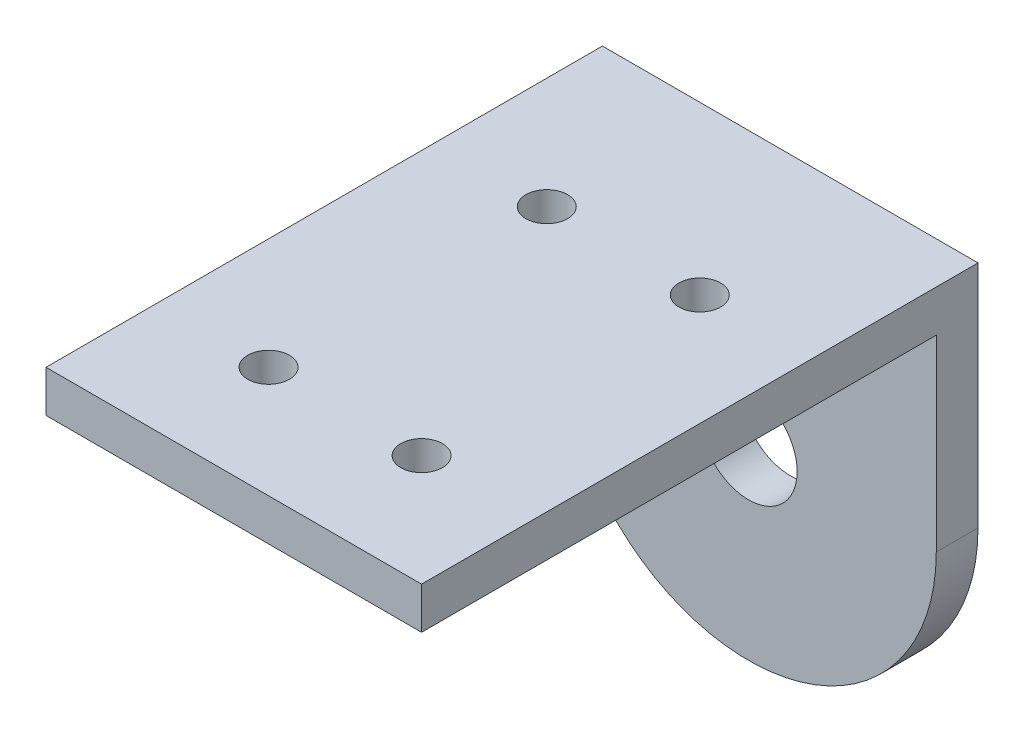
ISO-10303-21;
HEADER;
FILE_DESCRIPTION(('STEP AP214'),'2;1');
FILE_NAME('part.step','',(''),(''),'','','');
FILE_SCHEMA(('AUTOMOTIVE_DESIGN { 1 0 10303 214 1 1 1 1 }'));
ENDSEC;
DATA;
#1=APPLICATION_CONTEXT('core data for automotive mechanical design processes');
#2=APPLICATION_PROTOCOL_DEFINITION('international standard','automotive_design',2000,#1);
#3=PRODUCT_CONTEXT('',#1,'mechanical');
#4=PRODUCT('Part','Part','',(#3));
#5=PRODUCT_RELATED_PRODUCT_CATEGORY('part','',(#4));
#6=PRODUCT_DEFINITION_FORMATION('','',#4);
#7=PRODUCT_DEFINITION_CONTEXT('part definition',#1,'design');
#8=PRODUCT_DEFINITION('design','',#6,#7);
#9=PRODUCT_DEFINITION_SHAPE('','',#8);
#10=(LENGTH_UNIT() NAMED_UNIT(*) SI_UNIT(.MILLI.,.METRE.));
#11=(NAMED_UNIT(*) PLANE_ANGLE_UNIT() SI_UNIT($,.RADIAN.));
#12=(NAMED_UNIT(*) SI_UNIT($,.STERADIAN.) SOLID_ANGLE_UNIT());
#13=UNCERTAINTY_MEASURE_WITH_UNIT(LENGTH_MEASURE(1.E-05),#10,'distance_accuracy_value','');
#14=(GEOMETRIC_REPRESENTATION_CONTEXT(3) GLOBAL_UNCERTAINTY_ASSIGNED_CONTEXT((#13)) GLOBAL_UNIT_ASSIGNED_CONTEXT((#10,
#11,#12)) REPRESENTATION_CONTEXT('',''));
#15=CARTESIAN_POINT('',(0.,0.,0.));
#16=DIRECTION('',(0.,0.,1.));
#17=DIRECTION('',(1.,0.,0.));
#18=AXIS2_PLACEMENT_3D('',#15,#16,#17);
#19=CARTESIAN_POINT('',(2606.26671450499,1592.8264256332,40.));
#20=DIRECTION('',(0.,0.,1.));
#21=DIRECTION('',(1.,0.,0.));
#22=AXIS2_PLACEMENT_3D('',#19,#20,#21);
#23=PLANE('',#22);
#24=DIRECTION('',(1.,0.,0.));
#25=VECTOR('',#24,1.);
#26=CARTESIAN_POINT('',(2579.76671450502,1606.3264256332,40.));
#27=LINE('',#26,#25);
#28=CARTESIAN_POINT('',(2592.76671450499,1606.3264256332,40.));
#29=VERTEX_POINT('',#28);
#30=CARTESIAN_POINT('',(2619.76671450502,1606.3264256332,40.));
#31=VERTEX_POINT('',#30);
#32=EDGE_CURVE('E122',#29,#31,#27,.T.);
#33=ORIENTED_EDGE('',*,*,#32,.T.);
#34=DIRECTION('',(0.,1.,0.));
#35=VECTOR('',#34,1.);
#36=CARTESIAN_POINT('',(2619.76671450499,1592.8264256332,40.));
#37=LINE('',#36,#35);
#38=CARTESIAN_POINT('',(2619.76671450499,1609.3264256332,40.));
#39=VERTEX_POINT('',#38);
#40=EDGE_CURVE('E98',#31,#39,#37,.T.);
#41=ORIENTED_EDGE('',*,*,#40,.T.);
#42=DIRECTION('',(-1.,0.,0.));
#43=VECTOR('',#42,1.);
#44=CARTESIAN_POINT('',(2592.76671450499,1609.3264256332,40.));
#45=LINE('',#44,#43);
#46=CARTESIAN_POINT('',(2592.76671450499,1609.3264256332,40.));
#47=VERTEX_POINT('',#46);
#48=EDGE_CURVE('E58',#39,#47,#45,.T.);
#49=ORIENTED_EDGE('',*,*,#48,.T.);
#50=DIRECTION('',(0.,-1.,0.));
#51=VECTOR('',#50,1.);
#52=CARTESIAN_POINT('',(2592.76671450499,1592.8264256332,40.));
#53=LINE('',#52,#51);
#54=EDGE_CURVE('E89',#47,#29,#53,.T.);
#55=ORIENTED_EDGE('',*,*,#54,.T.);
#56=EDGE_LOOP('',(#33,#41,#49,#55));
#57=FACE_BOUND('',#56,.T.);
#58=ADVANCED_FACE('F32',(#57),#23,.T.);
#59=CARTESIAN_POINT('',(2606.26671450499,1592.8264256332,0.));
#60=DIRECTION('',(0.,0.,1.));
#61=DIRECTION('',(1.,0.,0.));
#62=AXIS2_PLACEMENT_3D('',#59,#60,#61);
#63=PLANE('',#62);
#64=CARTESIAN_POINT('',(2606.26671450499,1592.8264256332,0.));
#65=DIRECTION('',(0.,0.,1.));
#66=DIRECTION('',(1.,0.,0.));
#67=AXIS2_PLACEMENT_3D('',#64,#65,#66);
#68=CIRCLE('',#67,13.5000000000001);
#69=CARTESIAN_POINT('',(2592.76671450499,1592.8264256332,0.));
#70=VERTEX_POINT('',#69);
#71=CARTESIAN_POINT('',(2619.76671450499,1592.8264256332,0.));
#72=VERTEX_POINT('',#71);
#73=EDGE_CURVE('E82',#70,#72,#68,.T.);
#74=ORIENTED_EDGE('',*,*,#73,.F.);
#75=DIRECTION('',(0.,-1.,0.));
#76=VECTOR('',#75,1.);
#77=CARTESIAN_POINT('',(2592.76671450499,1592.8264256332,0.));
#78=LINE('',#77,#76);
#79=CARTESIAN_POINT('',(2592.76671450499,1609.3264256332,0.));
#80=VERTEX_POINT('',#79);
#81=EDGE_CURVE('E93',#80,#70,#78,.T.);
#82=ORIENTED_EDGE('',*,*,#81,.F.);
#83=DIRECTION('',(-1.,0.,0.));
#84=VECTOR('',#83,1.);
#85=CARTESIAN_POINT('',(2592.76671450499,1609.3264256332,0.));
#86=LINE('',#85,#84);
#87=CARTESIAN_POINT('',(2619.76671450499,1609.3264256332,0.));
#88=VERTEX_POINT('',#87);
#89=EDGE_CURVE('E99',#88,#80,#86,.T.);
#90=ORIENTED_EDGE('',*,*,#89,.F.);
#91=DIRECTION('',(0.,1.,0.));
#92=VECTOR('',#91,1.);
#93=CARTESIAN_POINT('',(2619.76671450499,1592.8264256332,0.));
#94=LINE('',#93,#92);
#95=EDGE_CURVE('E104',#72,#88,#94,.T.);
#96=ORIENTED_EDGE('',*,*,#95,.F.);
#97=EDGE_LOOP('',(#74,#82,#90,#96));
#98=FACE_BOUND('',#97,.T.);
#99=CARTESIAN_POINT('',(2606.26671450499,1592.8264256332,0.));
#100=DIRECTION('',(0.,0.,1.));
#101=DIRECTION('',(1.,0.,0.));
#102=AXIS2_PLACEMENT_3D('',#99,#100,#101);
#103=CIRCLE('',#102,3.49999999999984);
#104=CARTESIAN_POINT('',(2609.76671450499,1592.8264256332,0.));
#105=VERTEX_POINT('',#104);
#106=EDGE_CURVE('E105',#105,#105,#103,.T.);
#107=ORIENTED_EDGE('',*,*,#106,.T.);
#108=EDGE_LOOP('',(#107));
#109=FACE_BOUND('',#108,.T.);
#110=ADVANCED_FACE('F102',(#98,#109),#63,.F.);
#111=CARTESIAN_POINT('',(2606.26671450499,1592.8264256332,40.));
#112=DIRECTION('',(0.,0.,-1.));
#113=DIRECTION('',(-1.,0.,0.));
#114=AXIS2_PLACEMENT_3D('',#111,#112,#113);
#115=CYLINDRICAL_SURFACE('',#114,13.5000000000001);
#116=DIRECTION('',(0.,0.,-1.));
#117=VECTOR('',#116,1.);
#118=CARTESIAN_POINT('',(2619.76671450499,1592.8264256332,40.));
#119=LINE('',#118,#117);
#120=CARTESIAN_POINT('',(2619.76671450502,1592.8264256332,3.));
#121=VERTEX_POINT('',#120);
#122=EDGE_CURVE('E41',#121,#72,#119,.T.);
#123=ORIENTED_EDGE('',*,*,#122,.F.);
#124=CARTESIAN_POINT('',(2606.26671450499,1592.8264256332,3.));
#125=DIRECTION('',(0.,0.,-1.));
#126=DIRECTION('',(0.,1.,0.));
#127=AXIS2_PLACEMENT_3D('',#124,#125,#126);
#128=CIRCLE('',#127,13.5000000000001);
#129=CARTESIAN_POINT('',(2592.76671450499,1592.8264256332,3.));
#130=VERTEX_POINT('',#129);
#131=EDGE_CURVE('E85',#121,#130,#128,.T.);
#132=ORIENTED_EDGE('',*,*,#131,.T.);
#133=DIRECTION('',(0.,0.,-1.));
#134=VECTOR('',#133,1.);
#135=CARTESIAN_POINT('',(2592.76671450499,1592.8264256332,40.));
#136=LINE('',#135,#134);
#137=EDGE_CURVE('E78',#130,#70,#136,.T.);
#138=ORIENTED_EDGE('',*,*,#137,.T.);
#139=ORIENTED_EDGE('',*,*,#73,.T.);
#140=EDGE_LOOP('',(#123,#132,#138,#139));
#141=FACE_BOUND('',#140,.T.);
#142=ADVANCED_FACE('F34',(#141),#115,.T.);
#143=CARTESIAN_POINT('',(2619.76671450499,1592.8264256332,40.));
#144=DIRECTION('',(-1.,0.,0.));
#145=DIRECTION('',(0.,0.,1.));
#146=AXIS2_PLACEMENT_3D('',#143,#144,#145);
#147=PLANE('',#146);
#148=ORIENTED_EDGE('',*,*,#40,.F.);
#149=DIRECTION('',(0.,0.,1.));
#150=VECTOR('',#149,1.);
#151=CARTESIAN_POINT('',(2619.76671450502,1606.3264256332,40.));
#152=LINE('',#151,#150);
#153=CARTESIAN_POINT('',(2619.76671450502,1606.3264256332,3.));
#154=VERTEX_POINT('',#153);
#155=EDGE_CURVE('E150',#154,#31,#152,.T.);
#156=ORIENTED_EDGE('',*,*,#155,.F.);
#157=DIRECTION('',(0.,1.,0.));
#158=VECTOR('',#157,1.);
#159=CARTESIAN_POINT('',(2619.76671450502,1606.3264256332,3.));
#160=LINE('',#159,#158);
#161=EDGE_CURVE('E127',#121,#154,#160,.T.);
#162=ORIENTED_EDGE('',*,*,#161,.F.);
#163=ORIENTED_EDGE('',*,*,#122,.T.);
#164=ORIENTED_EDGE('',*,*,#95,.T.);
#165=DIRECTION('',(0.,0.,-1.));
#166=VECTOR('',#165,1.);
#167=CARTESIAN_POINT('',(2619.76671450499,1609.3264256332,40.));
#168=LINE('',#167,#166);
#169=EDGE_CURVE('E115',#39,#88,#168,.T.);
#170=ORIENTED_EDGE('',*,*,#169,.F.);
#171=EDGE_LOOP('',(#148,#156,#162,#163,#164,#170));
#172=FACE_BOUND('',#171,.T.);
#173=ADVANCED_FACE('F169',(#172),#147,.F.);
#174=CARTESIAN_POINT('',(2592.76671450499,1609.3264256332,40.));
#175=DIRECTION('',(0.,-1.,0.));
#176=DIRECTION('',(0.,0.,-1.));
#177=AXIS2_PLACEMENT_3D('',#174,#175,#176);
#178=PLANE('',#177);
#179=CARTESIAN_POINT('',(2600.76671450499,1609.3264256332,12.));
#180=DIRECTION('',(0.,1.,0.));
#181=DIRECTION('',(0.,0.,1.));
#182=AXIS2_PLACEMENT_3D('',#179,#180,#181);
#183=CIRCLE('',#182,1.50000000000008);
#184=CARTESIAN_POINT('',(2600.76671450499,1609.3264256332,13.5000000000001));
#185=VERTEX_POINT('',#184);
#186=EDGE_CURVE('E144',#185,#185,#183,.T.);
#187=ORIENTED_EDGE('',*,*,#186,.F.);
#188=EDGE_LOOP('',(#187));
#189=FACE_BOUND('',#188,.T.);
#190=CARTESIAN_POINT('',(2611.76671450499,1609.3264256332,12.));
#191=DIRECTION('',(0.,1.,0.));
#192=DIRECTION('',(0.,0.,1.));
#193=AXIS2_PLACEMENT_3D('',#190,#191,#192);
#194=CIRCLE('',#193,1.50000000000008);
#195=CARTESIAN_POINT('',(2611.76671450499,1609.3264256332,13.5000000000001));
#196=VERTEX_POINT('',#195);
#197=EDGE_CURVE('E134',#196,#196,#194,.T.);
#198=ORIENTED_EDGE('',*,*,#197,.F.);
#199=EDGE_LOOP('',(#198));
#200=FACE_BOUND('',#199,.T.);
#201=CARTESIAN_POINT('',(2611.76671450499,1609.3264256332,32.));
#202=DIRECTION('',(0.,1.,0.));
#203=DIRECTION('',(0.,0.,1.));
#204=AXIS2_PLACEMENT_3D('',#201,#202,#203);
#205=CIRCLE('',#204,1.50000000000008);
#206=CARTESIAN_POINT('',(2611.76671450499,1609.3264256332,33.5000000000001));
#207=VERTEX_POINT('',#206);
#208=EDGE_CURVE('E131',#207,#207,#205,.T.);
#209=ORIENTED_EDGE('',*,*,#208,.F.);
#210=EDGE_LOOP('',(#209));
#211=FACE_BOUND('',#210,.T.);
#212=CARTESIAN_POINT('',(2600.76671450499,1609.3264256332,32.));
#213=DIRECTION('',(0.,1.,0.));
#214=DIRECTION('',(0.,0.,1.));
#215=AXIS2_PLACEMENT_3D('',#212,#213,#214);
#216=CIRCLE('',#215,1.50000000000008);
#217=CARTESIAN_POINT('',(2600.76671450499,1609.3264256332,33.5000000000001));
#218=VERTEX_POINT('',#217);
#219=EDGE_CURVE('E128',#218,#218,#216,.T.);
#220=ORIENTED_EDGE('',*,*,#219,.F.);
#221=EDGE_LOOP('',(#220));
#222=FACE_BOUND('',#221,.T.);
#223=ORIENTED_EDGE('',*,*,#89,.T.);
#224=DIRECTION('',(0.,0.,-1.));
#225=VECTOR('',#224,1.);
#226=CARTESIAN_POINT('',(2592.76671450499,1609.3264256332,40.));
#227=LINE('',#226,#225);
#228=EDGE_CURVE('E88',#47,#80,#227,.T.);
#229=ORIENTED_EDGE('',*,*,#228,.F.);
#230=ORIENTED_EDGE('',*,*,#48,.F.);
#231=ORIENTED_EDGE('',*,*,#169,.T.);
#232=EDGE_LOOP('',(#223,#229,#230,#231));
#233=FACE_BOUND('',#232,.T.);
#234=ADVANCED_FACE('F199',(#189,#200,#211,#222,#233),#178,.F.);
#235=CARTESIAN_POINT('',(2592.76671450499,1592.8264256332,40.));
#236=DIRECTION('',(1.,0.,0.));
#237=DIRECTION('',(0.,0.,-1.));
#238=AXIS2_PLACEMENT_3D('',#235,#236,#237);
#239=PLANE('',#238);
#240=DIRECTION('',(0.,1.,0.));
#241=VECTOR('',#240,1.);
#242=CARTESIAN_POINT('',(2592.76671450499,1592.8264256332,3.));
#243=LINE('',#242,#241);
#244=CARTESIAN_POINT('',(2592.76671450499,1606.3264256332,3.));
#245=VERTEX_POINT('',#244);
#246=EDGE_CURVE('E121',#130,#245,#243,.T.);
#247=ORIENTED_EDGE('',*,*,#246,.T.);
#248=DIRECTION('',(0.,0.,1.));
#249=VECTOR('',#248,1.);
#250=CARTESIAN_POINT('',(2592.76671450499,1606.3264256332,40.));
#251=LINE('',#250,#249);
#252=EDGE_CURVE('E11',#245,#29,#251,.T.);
#253=ORIENTED_EDGE('',*,*,#252,.T.);
#254=ORIENTED_EDGE('',*,*,#54,.F.);
#255=ORIENTED_EDGE('',*,*,#228,.T.);
#256=ORIENTED_EDGE('',*,*,#81,.T.);
#257=ORIENTED_EDGE('',*,*,#137,.F.);
#258=EDGE_LOOP('',(#247,#253,#254,#255,#256,#257));
#259=FACE_BOUND('',#258,.T.);
#260=ADVANCED_FACE('F94',(#259),#239,.F.);
#261=CARTESIAN_POINT('',(2606.26671450499,1592.8264256332,40.));
#262=DIRECTION('',(0.,0.,-1.));
#263=DIRECTION('',(-1.,0.,0.));
#264=AXIS2_PLACEMENT_3D('',#261,#262,#263);
#265=CYLINDRICAL_SURFACE('',#264,3.49999999999984);
#266=CARTESIAN_POINT('',(2606.26671450499,1592.8264256332,3.));
#267=DIRECTION('',(0.,0.,-1.));
#268=DIRECTION('',(0.,1.,0.));
#269=AXIS2_PLACEMENT_3D('',#266,#267,#268);
#270=CIRCLE('',#269,3.49999999999984);
#271=CARTESIAN_POINT('',(2606.26671450499,1596.3264256332,3.));
#272=VERTEX_POINT('',#271);
#273=EDGE_CURVE('E119',#272,#272,#270,.T.);
#274=ORIENTED_EDGE('',*,*,#273,.F.);
#275=EDGE_LOOP('',(#274));
#276=FACE_BOUND('',#275,.T.);
#277=ORIENTED_EDGE('',*,*,#106,.F.);
#278=EDGE_LOOP('',(#277));
#279=FACE_BOUND('',#278,.T.);
#280=ADVANCED_FACE('F186',(#276,#279),#265,.F.);
#281=CARTESIAN_POINT('',(2579.76671450502,1606.3264256332,40.));
#282=DIRECTION('',(0.,1.,0.));
#283=DIRECTION('',(-1.,0.,0.));
#284=AXIS2_PLACEMENT_3D('',#281,#282,#283);
#285=PLANE('',#284);
#286=CARTESIAN_POINT('',(2600.76671450499,1606.3264256332,12.));
#287=DIRECTION('',(0.,1.,0.));
#288=DIRECTION('',(-1.,0.,0.));
#289=AXIS2_PLACEMENT_3D('',#286,#287,#288);
#290=CIRCLE('',#289,1.50000000000008);
#291=CARTESIAN_POINT('',(2599.26671450499,1606.3264256332,12.));
#292=VERTEX_POINT('',#291);
#293=EDGE_CURVE('E36',#292,#292,#290,.T.);
#294=ORIENTED_EDGE('',*,*,#293,.T.);
#295=EDGE_LOOP('',(#294));
#296=FACE_BOUND('',#295,.T.);
#297=CARTESIAN_POINT('',(2611.76671450499,1606.3264256332,12.));
#298=DIRECTION('',(0.,1.,0.));
#299=DIRECTION('',(-1.,0.,0.));
#300=AXIS2_PLACEMENT_3D('',#297,#298,#299);
#301=CIRCLE('',#300,1.50000000000008);
#302=CARTESIAN_POINT('',(2610.26671450499,1606.3264256332,12.));
#303=VERTEX_POINT('',#302);
#304=EDGE_CURVE('E132',#303,#303,#301,.T.);
#305=ORIENTED_EDGE('',*,*,#304,.T.);
#306=EDGE_LOOP('',(#305));
#307=FACE_BOUND('',#306,.T.);
#308=CARTESIAN_POINT('',(2611.76671450499,1606.3264256332,32.));
#309=DIRECTION('',(0.,1.,0.));
#310=DIRECTION('',(-1.,0.,0.));
#311=AXIS2_PLACEMENT_3D('',#308,#309,#310);
#312=CIRCLE('',#311,1.50000000000008);
#313=CARTESIAN_POINT('',(2610.26671450499,1606.3264256332,32.));
#314=VERTEX_POINT('',#313);
#315=EDGE_CURVE('E129',#314,#314,#312,.T.);
#316=ORIENTED_EDGE('',*,*,#315,.T.);
#317=EDGE_LOOP('',(#316));
#318=FACE_BOUND('',#317,.T.);
#319=CARTESIAN_POINT('',(2600.76671450499,1606.3264256332,32.));
#320=DIRECTION('',(0.,1.,0.));
#321=DIRECTION('',(-1.,0.,0.));
#322=AXIS2_PLACEMENT_3D('',#319,#320,#321);
#323=CIRCLE('',#322,1.50000000000008);
#324=CARTESIAN_POINT('',(2599.26671450499,1606.3264256332,32.));
#325=VERTEX_POINT('',#324);
#326=EDGE_CURVE('E124',#325,#325,#323,.T.);
#327=ORIENTED_EDGE('',*,*,#326,.T.);
#328=EDGE_LOOP('',(#327));
#329=FACE_BOUND('',#328,.T.);
#330=DIRECTION('',(1.,0.,0.));
#331=VECTOR('',#330,1.);
#332=CARTESIAN_POINT('',(2579.76671450502,1606.3264256332,3.));
#333=LINE('',#332,#331);
#334=EDGE_CURVE('E49',#245,#154,#333,.T.);
#335=ORIENTED_EDGE('',*,*,#334,.T.);
#336=ORIENTED_EDGE('',*,*,#155,.T.);
#337=ORIENTED_EDGE('',*,*,#32,.F.);
#338=ORIENTED_EDGE('',*,*,#252,.F.);
#339=EDGE_LOOP('',(#335,#336,#337,#338));
#340=FACE_BOUND('',#339,.T.);
#341=ADVANCED_FACE('F162',(#296,#307,#318,#329,#340),#285,.F.);
#342=CARTESIAN_POINT('',(2579.76671450502,1606.3264256332,3.));
#343=DIRECTION('',(0.,0.,-1.));
#344=DIRECTION('',(0.,1.,0.));
#345=AXIS2_PLACEMENT_3D('',#342,#343,#344);
#346=PLANE('',#345);
#347=ORIENTED_EDGE('',*,*,#273,.T.);
#348=EDGE_LOOP('',(#347));
#349=FACE_BOUND('',#348,.T.);
#350=ORIENTED_EDGE('',*,*,#161,.T.);
#351=ORIENTED_EDGE('',*,*,#334,.F.);
#352=ORIENTED_EDGE('',*,*,#246,.F.);
#353=ORIENTED_EDGE('',*,*,#131,.F.);
#354=EDGE_LOOP('',(#350,#351,#352,#353));
#355=FACE_BOUND('',#354,.T.);
#356=ADVANCED_FACE('F174',(#349,#355),#346,.F.);
#357=CARTESIAN_POINT('',(2600.76671450499,1569.3264256332,32.));
#358=DIRECTION('',(0.,1.,0.));
#359=DIRECTION('',(0.,0.,1.));
#360=AXIS2_PLACEMENT_3D('',#357,#358,#359);
#361=CYLINDRICAL_SURFACE('',#360,1.50000000000008);
#362=ORIENTED_EDGE('',*,*,#219,.T.);
#363=EDGE_LOOP('',(#362));
#364=FACE_BOUND('',#363,.T.);
#365=ORIENTED_EDGE('',*,*,#326,.F.);
#366=EDGE_LOOP('',(#365));
#367=FACE_BOUND('',#366,.T.);
#368=ADVANCED_FACE('F176',(#364,#367),#361,.F.);
#369=CARTESIAN_POINT('',(2611.76671450499,1569.3264256332,32.));
#370=DIRECTION('',(0.,1.,0.));
#371=DIRECTION('',(0.,0.,1.));
#372=AXIS2_PLACEMENT_3D('',#369,#370,#371);
#373=CYLINDRICAL_SURFACE('',#372,1.50000000000008);
#374=ORIENTED_EDGE('',*,*,#208,.T.);
#375=EDGE_LOOP('',(#374));
#376=FACE_BOUND('',#375,.T.);
#377=ORIENTED_EDGE('',*,*,#315,.F.);
#378=EDGE_LOOP('',(#377));
#379=FACE_BOUND('',#378,.T.);
#380=ADVANCED_FACE('F183',(#376,#379),#373,.F.);
#381=CARTESIAN_POINT('',(2611.76671450499,1569.3264256332,12.));
#382=DIRECTION('',(0.,1.,0.));
#383=DIRECTION('',(0.,0.,1.));
#384=AXIS2_PLACEMENT_3D('',#381,#382,#383);
#385=CYLINDRICAL_SURFACE('',#384,1.50000000000008);
#386=ORIENTED_EDGE('',*,*,#197,.T.);
#387=EDGE_LOOP('',(#386));
#388=FACE_BOUND('',#387,.T.);
#389=ORIENTED_EDGE('',*,*,#304,.F.);
#390=EDGE_LOOP('',(#389));
#391=FACE_BOUND('',#390,.T.);
#392=ADVANCED_FACE('F263',(#388,#391),#385,.F.);
#393=CARTESIAN_POINT('',(2600.76671450499,1569.3264256332,12.));
#394=DIRECTION('',(0.,1.,0.));
#395=DIRECTION('',(0.,0.,1.));
#396=AXIS2_PLACEMENT_3D('',#393,#394,#395);
#397=CYLINDRICAL_SURFACE('',#396,1.50000000000008);
#398=ORIENTED_EDGE('',*,*,#186,.T.);
#399=EDGE_LOOP('',(#398));
#400=FACE_BOUND('',#399,.T.);
#401=ORIENTED_EDGE('',*,*,#293,.F.);
#402=EDGE_LOOP('',(#401));
#403=FACE_BOUND('',#402,.T.);
#404=ADVANCED_FACE('F272',(#400,#403),#397,.F.);
#405=CLOSED_SHELL('',(#58,#110,#142,#173,#234,#260,#280,#341,#356,#368,#380,#392,#404));
#406=MANIFOLD_SOLID_BREP('B2',#405);
#407=ADVANCED_BREP_SHAPE_REPRESENTATION('',(#18,#406),#14);
#408=SHAPE_DEFINITION_REPRESENTATION(#9,#407);
ENDSEC;
END-ISO-10303-21;
